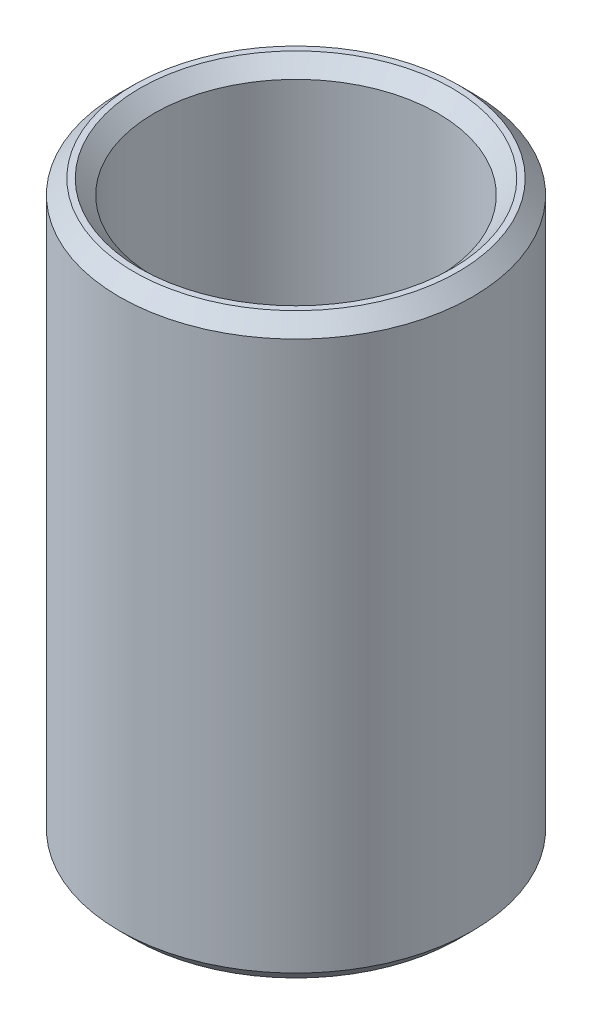
ISO-10303-21;
HEADER;
FILE_DESCRIPTION(('STEP AP214'),'2;1');
FILE_NAME('part.step','',(''),(''),'','','');
FILE_SCHEMA(('AUTOMOTIVE_DESIGN { 1 0 10303 214 1 1 1 1 }'));
ENDSEC;
DATA;
#1=APPLICATION_CONTEXT('core data for automotive mechanical design processes');
#2=APPLICATION_PROTOCOL_DEFINITION('international standard','automotive_design',2000,#1);
#3=PRODUCT_CONTEXT('',#1,'mechanical');
#4=PRODUCT('Part','Part','',(#3));
#5=PRODUCT_RELATED_PRODUCT_CATEGORY('part','',(#4));
#6=PRODUCT_DEFINITION_FORMATION('','',#4);
#7=PRODUCT_DEFINITION_CONTEXT('part definition',#1,'design');
#8=PRODUCT_DEFINITION('design','',#6,#7);
#9=PRODUCT_DEFINITION_SHAPE('','',#8);
#10=(LENGTH_UNIT() NAMED_UNIT(*) SI_UNIT(.MILLI.,.METRE.));
#11=(NAMED_UNIT(*) PLANE_ANGLE_UNIT() SI_UNIT($,.RADIAN.));
#12=(NAMED_UNIT(*) SI_UNIT($,.STERADIAN.) SOLID_ANGLE_UNIT());
#13=UNCERTAINTY_MEASURE_WITH_UNIT(LENGTH_MEASURE(1.E-05),#10,'distance_accuracy_value','');
#14=(GEOMETRIC_REPRESENTATION_CONTEXT(3) GLOBAL_UNCERTAINTY_ASSIGNED_CONTEXT((#13)) GLOBAL_UNIT_ASSIGNED_CONTEXT((#10,
#11,#12)) REPRESENTATION_CONTEXT('',''));
#15=CARTESIAN_POINT('',(0.,0.,0.));
#16=DIRECTION('',(0.,0.,1.));
#17=DIRECTION('',(1.,0.,0.));
#18=AXIS2_PLACEMENT_3D('',#15,#16,#17);
#19=CARTESIAN_POINT('',(0.,147.334308334279,0.));
#20=DIRECTION('',(0.,-1.,0.));
#21=DIRECTION('',(0.,0.,-1.));
#22=AXIS2_PLACEMENT_3D('',#19,#20,#21);
#23=CYLINDRICAL_SURFACE('',#22,45.);
#24=CARTESIAN_POINT('',(0.,3.68020604457242,0.));
#25=DIRECTION('',(0.,1.,0.));
#26=DIRECTION('',(0.,0.,1.));
#27=AXIS2_PLACEMENT_3D('',#24,#25,#26);
#28=CIRCLE('',#27,45.);
#29=CARTESIAN_POINT('',(0.,3.68020604457242,-45.));
#30=VERTEX_POINT('',#29);
#31=EDGE_CURVE('E10',#30,#30,#28,.T.);
#32=CARTESIAN_POINT('',(0.,143.654102289707,0.));
#33=DIRECTION('',(0.,1.,0.));
#34=DIRECTION('',(0.,0.,1.));
#35=AXIS2_PLACEMENT_3D('',#32,#33,#34);
#36=CIRCLE('',#35,45.);
#37=CARTESIAN_POINT('',(0.,143.654102289707,-45.));
#38=VERTEX_POINT('',#37);
#39=EDGE_CURVE('E50',#38,#38,#36,.F.);
#40=CARTESIAN_POINT('',(0.,3.68020604457242,-45.));
#41=CARTESIAN_POINT('',(0.,5.13826746379257,-45.));
#42=CARTESIAN_POINT('',(0.,6.59632888301272,-45.));
#43=CARTESIAN_POINT('',(0.,9.51245172145301,-45.));
#44=CARTESIAN_POINT('',(0.,10.9705131406732,-45.));
#45=CARTESIAN_POINT('',(0.,13.8866359791134,-45.));
#46=CARTESIAN_POINT('',(0.,15.3446973983336,-45.));
#47=CARTESIAN_POINT('',(0.,18.2608202367739,-45.));
#48=CARTESIAN_POINT('',(0.,19.718881655994,-45.));
#49=CARTESIAN_POINT('',(0.,22.6350044944343,-45.));
#50=CARTESIAN_POINT('',(0.,24.0930659136545,-45.));
#51=CARTESIAN_POINT('',(0.,27.0091887520948,-45.));
#52=CARTESIAN_POINT('',(0.,28.4672501713149,-45.));
#53=CARTESIAN_POINT('',(0.,31.3833730097552,-45.));
#54=CARTESIAN_POINT('',(0.,32.8414344289754,-45.));
#55=CARTESIAN_POINT('',(0.,35.7575572674157,-45.));
#56=CARTESIAN_POINT('',(0.,37.2156186866358,-45.));
#57=CARTESIAN_POINT('',(0.,40.1317415250761,-45.));
#58=CARTESIAN_POINT('',(0.,41.5898029442962,-45.));
#59=CARTESIAN_POINT('',(0.,44.5059257827365,-45.));
#60=CARTESIAN_POINT('',(0.,45.9639872019567,-45.));
#61=CARTESIAN_POINT('',(0.,48.880110040397,-45.));
#62=CARTESIAN_POINT('',(0.,50.3381714596171,-45.));
#63=CARTESIAN_POINT('',(0.,53.2542942980574,-45.));
#64=CARTESIAN_POINT('',(0.,54.7123557172776,-45.));
#65=CARTESIAN_POINT('',(0.,57.6284785557179,-45.));
#66=CARTESIAN_POINT('',(0.,59.086539974938,-45.));
#67=CARTESIAN_POINT('',(0.,62.0026628133783,-45.));
#68=CARTESIAN_POINT('',(0.,63.4607242325985,-45.));
#69=CARTESIAN_POINT('',(0.,66.3768470710388,-45.));
#70=CARTESIAN_POINT('',(0.,67.8349084902589,-45.));
#71=CARTESIAN_POINT('',(0.,70.7510313286992,-45.));
#72=CARTESIAN_POINT('',(0.,72.2090927479193,-45.));
#73=CARTESIAN_POINT('',(0.,75.1252155863596,-45.));
#74=CARTESIAN_POINT('',(0.,76.5832770055798,-45.));
#75=CARTESIAN_POINT('',(0.,79.4993998440201,-45.));
#76=CARTESIAN_POINT('',(0.,80.9574612632402,-45.));
#77=CARTESIAN_POINT('',(0.,83.8735841016805,-45.));
#78=CARTESIAN_POINT('',(0.,85.3316455209007,-45.));
#79=CARTESIAN_POINT('',(0.,88.247768359341,-45.));
#80=CARTESIAN_POINT('',(0.,89.7058297785611,-45.));
#81=CARTESIAN_POINT('',(0.,92.6219526170014,-45.));
#82=CARTESIAN_POINT('',(0.,94.0800140362215,-45.));
#83=CARTESIAN_POINT('',(0.,96.9961368746618,-45.));
#84=CARTESIAN_POINT('',(0.,98.454198293882,-45.));
#85=CARTESIAN_POINT('',(0.,101.370321132322,-45.));
#86=CARTESIAN_POINT('',(0.,102.828382551542,-45.));
#87=CARTESIAN_POINT('',(0.,105.744505389983,-45.));
#88=CARTESIAN_POINT('',(0.,107.202566809203,-45.));
#89=CARTESIAN_POINT('',(0.,110.118689647643,-45.));
#90=CARTESIAN_POINT('',(0.,111.576751066863,-45.));
#91=CARTESIAN_POINT('',(0.,114.492873905304,-45.));
#92=CARTESIAN_POINT('',(0.,115.950935324524,-45.));
#93=CARTESIAN_POINT('',(0.,118.867058162964,-45.));
#94=CARTESIAN_POINT('',(0.,120.325119582184,-45.));
#95=CARTESIAN_POINT('',(0.,123.241242420624,-45.));
#96=CARTESIAN_POINT('',(0.,124.699303839845,-45.));
#97=CARTESIAN_POINT('',(0.,127.615426678285,-45.));
#98=CARTESIAN_POINT('',(0.,129.073488097505,-45.));
#99=CARTESIAN_POINT('',(0.,131.989610935945,-45.));
#100=CARTESIAN_POINT('',(0.,133.447672355166,-45.));
#101=CARTESIAN_POINT('',(0.,136.363795193606,-45.));
#102=CARTESIAN_POINT('',(0.,137.821856612826,-45.));
#103=CARTESIAN_POINT('',(0.,140.737979451266,-45.));
#104=CARTESIAN_POINT('',(0.,142.196040870486,-45.));
#105=CARTESIAN_POINT('',(0.,143.654102289707,-45.));
#106=B_SPLINE_CURVE_WITH_KNOTS('',3,(#40,#41,#42,#43,#44,#45,#46,#47,#48,#49,#50,#51,#52,#53,
#54,#55,#56,#57,#58,#59,#60,#61,#62,#63,#64,#65,#66,#67,#68,#69,#70,#71,#72,#73,#74,#75,#76,#77,
#78,#79,#80,#81,#82,#83,#84,#85,#86,#87,#88,#89,#90,#91,#92,#93,#94,#95,#96,#97,#98,#99,#100,
#101,#102,#103,#104,#105),.UNSPECIFIED.,.F.,.F.,(4,2,2,2,2,2,2,2,2,2,2,2,2,2,2,2,2,2,2,2,2,2,2,
2,2,2,2,2,2,2,2,2,4),(0.,4.37418425766045,8.74836851532088,13.1225527729813,17.4967370306418,
21.8709212883022,26.2451055459627,30.6192898036231,34.9934740612835,39.367658318944,
43.7418425766044,48.1160268342649,52.4902110919253,56.8643953495857,61.2385796072462,
65.6127638649066,69.9869481225671,74.3611323802275,78.7353166378879,83.1095008955484,
87.4836851532088,91.8578694108693,96.2320536685297,100.60623792619,104.980422183851,
109.354606441511,113.728790699171,118.102974956832,122.477159214492,126.851343472153,
131.225527729813,135.599711987474,139.973896245134),.UNSPECIFIED.);
#107=EDGE_CURVE('BSEAM39',#30,#38,#106,.T.);
#108=ORIENTED_EDGE('',*,*,#31,.T.);
#109=ORIENTED_EDGE('',*,*,#39,.T.);
#110=ORIENTED_EDGE('',*,*,#107,.T.);
#111=ORIENTED_EDGE('',*,*,#107,.F.);
#112=EDGE_LOOP('',(#108,#110,#109,#111));
#113=FACE_BOUND('',#112,.T.);
#114=ADVANCED_FACE('F39',(#113),#23,.T.);
#115=CARTESIAN_POINT('',(0.,147.334308334279,0.));
#116=DIRECTION('',(0.,1.,0.));
#117=DIRECTION('',(0.,0.,1.));
#118=AXIS2_PLACEMENT_3D('',#115,#116,#117);
#119=PLANE('',#118);
#120=CARTESIAN_POINT('',(0.,147.334308334279,0.));
#121=DIRECTION('',(0.,1.,0.));
#122=DIRECTION('',(0.,0.,1.));
#123=AXIS2_PLACEMENT_3D('',#120,#121,#122);
#124=CIRCLE('',#123,39.7986737036994);
#125=CARTESIAN_POINT('',(0.,147.334308334279,39.7986737036994));
#126=VERTEX_POINT('',#125);
#127=EDGE_CURVE('E58',#126,#126,#124,.F.);
#128=ORIENTED_EDGE('',*,*,#127,.T.);
#129=EDGE_LOOP('',(#128));
#130=FACE_BOUND('',#129,.T.);
#131=CARTESIAN_POINT('',(0.,147.334308334279,0.));
#132=DIRECTION('',(0.,1.,0.));
#133=DIRECTION('',(0.,0.,1.));
#134=AXIS2_PLACEMENT_3D('',#131,#132,#133);
#135=CIRCLE('',#134,41.3197939554276);
#136=CARTESIAN_POINT('',(0.,147.334308334279,-41.3197939554276));
#137=VERTEX_POINT('',#136);
#138=EDGE_CURVE('E61',#137,#137,#135,.T.);
#139=ORIENTED_EDGE('',*,*,#138,.T.);
#140=EDGE_LOOP('',(#139));
#141=FACE_BOUND('',#140,.T.);
#142=ADVANCED_FACE('F88',(#130,#141),#119,.T.);
#143=CARTESIAN_POINT('',(0.,0.,0.));
#144=DIRECTION('',(0.,1.,0.));
#145=DIRECTION('',(0.,0.,1.));
#146=AXIS2_PLACEMENT_3D('',#143,#144,#145);
#147=PLANE('',#146);
#148=CARTESIAN_POINT('',(0.,0.,0.));
#149=DIRECTION('',(0.,1.,0.));
#150=DIRECTION('',(0.,0.,1.));
#151=AXIS2_PLACEMENT_3D('',#148,#149,#150);
#152=CIRCLE('',#151,39.7986737036993);
#153=CARTESIAN_POINT('',(0.,0.,-39.7986737036993));
#154=VERTEX_POINT('',#153);
#155=EDGE_CURVE('E51',#154,#154,#152,.T.);
#156=ORIENTED_EDGE('',*,*,#155,.T.);
#157=EDGE_LOOP('',(#156));
#158=FACE_BOUND('',#157,.T.);
#159=CARTESIAN_POINT('',(0.,0.,0.));
#160=DIRECTION('',(0.,1.,0.));
#161=DIRECTION('',(0.,0.,1.));
#162=AXIS2_PLACEMENT_3D('',#159,#160,#161);
#163=CIRCLE('',#162,41.3197939554276);
#164=CARTESIAN_POINT('',(0.,0.,41.3197939554276));
#165=VERTEX_POINT('',#164);
#166=EDGE_CURVE('E54',#165,#165,#163,.F.);
#167=ORIENTED_EDGE('',*,*,#166,.T.);
#168=EDGE_LOOP('',(#167));
#169=FACE_BOUND('',#168,.T.);
#170=ADVANCED_FACE('F83',(#158,#169),#147,.F.);
#171=CARTESIAN_POINT('',(0.,147.334308334279,0.));
#172=DIRECTION('',(0.,-1.,0.));
#173=DIRECTION('',(0.,0.,-1.));
#174=AXIS2_PLACEMENT_3D('',#171,#172,#173);
#175=CYLINDRICAL_SURFACE('',#174,36.1184676591269);
#176=CARTESIAN_POINT('',(0.,143.654102289706,0.));
#177=DIRECTION('',(0.,1.,0.));
#178=DIRECTION('',(0.,0.,1.));
#179=AXIS2_PLACEMENT_3D('',#176,#177,#178);
#180=CIRCLE('',#179,36.1184676591269);
#181=CARTESIAN_POINT('',(0.,143.654102289706,36.1184676591269));
#182=VERTEX_POINT('',#181);
#183=EDGE_CURVE('E67',#182,#182,#180,.T.);
#184=ORIENTED_EDGE('',*,*,#183,.T.);
#185=EDGE_LOOP('',(#184));
#186=FACE_BOUND('',#185,.T.);
#187=CARTESIAN_POINT('',(0.,3.68020604457248,0.));
#188=DIRECTION('',(0.,1.,0.));
#189=DIRECTION('',(0.,0.,1.));
#190=AXIS2_PLACEMENT_3D('',#187,#188,#189);
#191=CIRCLE('',#190,36.1184676591269);
#192=CARTESIAN_POINT('',(0.,3.68020604457248,-36.1184676591269));
#193=VERTEX_POINT('',#192);
#194=EDGE_CURVE('E69',#193,#193,#191,.F.);
#195=ORIENTED_EDGE('',*,*,#194,.T.);
#196=EDGE_LOOP('',(#195));
#197=FACE_BOUND('',#196,.T.);
#198=ADVANCED_FACE('F71',(#186,#197),#175,.F.);
#199=CARTESIAN_POINT('',(0.,143.654102289706,0.));
#200=DIRECTION('',(0.,1.,0.));
#201=DIRECTION('',(0.,0.,1.));
#202=AXIS2_PLACEMENT_3D('',#199,#200,#201);
#203=CONICAL_SURFACE('',#202,36.1184676591269,0.78539816339745);
#204=ORIENTED_EDGE('',*,*,#127,.F.);
#205=EDGE_LOOP('',(#204));
#206=FACE_BOUND('',#205,.T.);
#207=ORIENTED_EDGE('',*,*,#183,.F.);
#208=EDGE_LOOP('',(#207));
#209=FACE_BOUND('',#208,.T.);
#210=ADVANCED_FACE('F77',(#206,#209),#203,.F.);
#211=CARTESIAN_POINT('',(0.,0.,0.));
#212=DIRECTION('',(0.,-1.,0.));
#213=DIRECTION('',(0.,0.,-1.));
#214=AXIS2_PLACEMENT_3D('',#211,#212,#213);
#215=CONICAL_SURFACE('',#214,39.7986737036993,0.785398163397445);
#216=CARTESIAN_POINT('',(0.,3.68020604457248,-36.1184676591269));
#217=CARTESIAN_POINT('',(0.,3.64187056494151,-36.1568031387579));
#218=CARTESIAN_POINT('',(0.,3.60353508531055,-36.1951386183888));
#219=CARTESIAN_POINT('',(0.,3.52686412604862,-36.2718095776507));
#220=CARTESIAN_POINT('',(0.,3.48852864641766,-36.3101450572817));
#221=CARTESIAN_POINT('',(0.,3.41185768715573,-36.3868160165436));
#222=CARTESIAN_POINT('',(0.,3.37352220752477,-36.4251514961746));
#223=CARTESIAN_POINT('',(0.,3.29685124826284,-36.5018224554365));
#224=CARTESIAN_POINT('',(0.,3.25851576863188,-36.5401579350675));
#225=CARTESIAN_POINT('',(0.,3.18184480936995,-36.6168288943294));
#226=CARTESIAN_POINT('',(0.,3.14350932973899,-36.6551643739604));
#227=CARTESIAN_POINT('',(0.,3.06683837047706,-36.7318353332223));
#228=CARTESIAN_POINT('',(0.,3.0285028908461,-36.7701708128533));
#229=CARTESIAN_POINT('',(0.,2.95183193158417,-36.8468417721152));
#230=CARTESIAN_POINT('',(0.,2.91349645195321,-36.8851772517462));
#231=CARTESIAN_POINT('',(0.,2.83682549269128,-36.9618482110081));
#232=CARTESIAN_POINT('',(0.,2.79849001306032,-37.000183690639));
#233=CARTESIAN_POINT('',(0.,2.72181905379839,-37.076854649901));
#234=CARTESIAN_POINT('',(0.,2.68348357416743,-37.1151901295319));
#235=CARTESIAN_POINT('',(0.,2.6068126149055,-37.1918610887939));
#236=CARTESIAN_POINT('',(0.,2.56847713527454,-37.2301965684248));
#237=CARTESIAN_POINT('',(0.,2.49180617601261,-37.3068675276867));
#238=CARTESIAN_POINT('',(0.,2.45347069638165,-37.3452030073177));
#239=CARTESIAN_POINT('',(0.,2.37679973711972,-37.4218739665796));
#240=CARTESIAN_POINT('',(0.,2.33846425748876,-37.4602094462106));
#241=CARTESIAN_POINT('',(0.,2.26179329822683,-37.5368804054725));
#242=CARTESIAN_POINT('',(0.,2.22345781859587,-37.5752158851035));
#243=CARTESIAN_POINT('',(0.,2.14678685933394,-37.6518868443654));
#244=CARTESIAN_POINT('',(0.,2.10845137970298,-37.6902223239964));
#245=CARTESIAN_POINT('',(0.,2.03178042044105,-37.7668932832583));
#246=CARTESIAN_POINT('',(0.,1.99344494081009,-37.8052287628893));
#247=CARTESIAN_POINT('',(0.,1.91677398154816,-37.8818997221512));
#248=CARTESIAN_POINT('',(0.,1.8784385019172,-37.9202352017822));
#249=CARTESIAN_POINT('',(0.,1.80176754265527,-37.9969061610441));
#250=CARTESIAN_POINT('',(0.,1.76343206302431,-38.035241640675));
#251=CARTESIAN_POINT('',(0.,1.68676110376238,-38.111912599937));
#252=CARTESIAN_POINT('',(0.,1.64842562413142,-38.1502480795679));
#253=CARTESIAN_POINT('',(0.,1.57175466486949,-38.2269190388299));
#254=CARTESIAN_POINT('',(0.,1.53341918523853,-38.2652545184608));
#255=CARTESIAN_POINT('',(0.,1.4567482259766,-38.3419254777227));
#256=CARTESIAN_POINT('',(0.,1.41841274634564,-38.3802609573537));
#257=CARTESIAN_POINT('',(0.,1.34174178708371,-38.4569319166156));
#258=CARTESIAN_POINT('',(0.,1.30340630745275,-38.4952673962466));
#259=CARTESIAN_POINT('',(0.,1.22673534819083,-38.5719383555085));
#260=CARTESIAN_POINT('',(0.,1.18839986855986,-38.6102738351395));
#261=CARTESIAN_POINT('',(0.,1.11172890929793,-38.6869447944014));
#262=CARTESIAN_POINT('',(0.,1.07339342966697,-38.7252802740324));
#263=CARTESIAN_POINT('',(0.,0.996722470405045,-38.8019512332943));
#264=CARTESIAN_POINT('',(0.,0.958386990774082,-38.8402867129253));
#265=CARTESIAN_POINT('',(0.,0.881716031512156,-38.9169576721872));
#266=CARTESIAN_POINT('',(0.,0.843380551881192,-38.9552931518182));
#267=CARTESIAN_POINT('',(0.,0.766709592619266,-39.0319641110801));
#268=CARTESIAN_POINT('',(0.,0.728374112988303,-39.070299590711));
#269=CARTESIAN_POINT('',(0.,0.651703153726376,-39.146970549973));
#270=CARTESIAN_POINT('',(0.,0.613367674095412,-39.1853060296039));
#271=CARTESIAN_POINT('',(0.,0.536696714833486,-39.2619769888659));
#272=CARTESIAN_POINT('',(0.,0.498361235202523,-39.3003124684968));
#273=CARTESIAN_POINT('',(0.,0.421690275940597,-39.3769834277588));
#274=CARTESIAN_POINT('',(0.,0.383354796309633,-39.4153189073897));
#275=CARTESIAN_POINT('',(0.,0.306683837047706,-39.4919898666516));
#276=CARTESIAN_POINT('',(0.,0.268348357416743,-39.5303253462826));
#277=CARTESIAN_POINT('',(0.,0.191677398154816,-39.6069963055445));
#278=CARTESIAN_POINT('',(0.,0.153341918523853,-39.6453317851755));
#279=CARTESIAN_POINT('',(0.,0.0766709592619265,-39.7220027444374));
#280=CARTESIAN_POINT('',(0.,0.0383354796309632,-39.7603382240684));
#281=CARTESIAN_POINT('',(0.,0.,-39.7986737036993));
#282=B_SPLINE_CURVE_WITH_KNOTS('',3,(#216,#217,#218,#219,#220,#221,#222,#223,#224,#225,#226,
#227,#228,#229,#230,#231,#232,#233,#234,#235,#236,#237,#238,#239,#240,#241,#242,#243,#244,#245,
#246,#247,#248,#249,#250,#251,#252,#253,#254,#255,#256,#257,#258,#259,#260,#261,#262,#263,#264,
#265,#266,#267,#268,#269,#270,#271,#272,#273,#274,#275,#276,#277,#278,#279,#280,#281),
.UNSPECIFIED.,.F.,.F.,(4,2,2,2,2,2,2,2,2,2,2,2,2,2,2,2,2,2,2,2,2,2,2,2,2,2,2,2,2,2,2,2,4),(0.,
0.162643665642556,0.325287331285112,0.487930996927669,0.650574662570225,0.813218328212786,
0.975861993855342,1.1385056594979,1.30114932514045,1.46379299078301,1.62643665642557,
1.78908032206812,1.95172398771068,2.11436765335324,2.2770113189958,2.43965498463835,
2.60229865028091,2.76494231592347,2.92758598156602,3.09022964720858,3.25287331285113,
3.4155169784937,3.57816064413625,3.74080430977881,3.90344797542137,4.06609164106392,
4.22873530670648,4.39137897234903,4.5540226379916,4.71666630363415,4.87930996927671,
5.04195363491926,5.20459730056182),.UNSPECIFIED.);
#283=EDGE_CURVE('BSEAM73',#193,#154,#282,.T.);
#284=ORIENTED_EDGE('',*,*,#194,.F.);
#285=ORIENTED_EDGE('',*,*,#155,.F.);
#286=ORIENTED_EDGE('',*,*,#283,.T.);
#287=ORIENTED_EDGE('',*,*,#283,.F.);
#288=EDGE_LOOP('',(#284,#286,#285,#287));
#289=FACE_BOUND('',#288,.T.);
#290=ADVANCED_FACE('F73',(#289),#215,.F.);
#291=CARTESIAN_POINT('',(0.,3.68020604457242,0.));
#292=DIRECTION('',(0.,1.,0.));
#293=DIRECTION('',(0.,0.,1.));
#294=AXIS2_PLACEMENT_3D('',#291,#292,#293);
#295=CONICAL_SURFACE('',#294,45.,0.785398163397452);
#296=ORIENTED_EDGE('',*,*,#166,.F.);
#297=EDGE_LOOP('',(#296));
#298=FACE_BOUND('',#297,.T.);
#299=ORIENTED_EDGE('',*,*,#31,.F.);
#300=EDGE_LOOP('',(#299));
#301=FACE_BOUND('',#300,.T.);
#302=ADVANCED_FACE('F76',(#298,#301),#295,.T.);
#303=CARTESIAN_POINT('',(0.,147.334308334279,0.));
#304=DIRECTION('',(0.,-1.,0.));
#305=DIRECTION('',(0.,0.,-1.));
#306=AXIS2_PLACEMENT_3D('',#303,#304,#305);
#307=CONICAL_SURFACE('',#306,41.3197939554276,0.785398163397443);
#308=CARTESIAN_POINT('',(0.,143.654102289707,-45.));
#309=CARTESIAN_POINT('',(0.,143.692437769337,-44.9616645203691));
#310=CARTESIAN_POINT('',(0.,143.730773248968,-44.9233290407381));
#311=CARTESIAN_POINT('',(0.,143.80744420823,-44.8466580814762));
#312=CARTESIAN_POINT('',(0.,143.845779687861,-44.8083226018452));
#313=CARTESIAN_POINT('',(0.,143.922450647123,-44.7316516425833));
#314=CARTESIAN_POINT('',(0.,143.960786126754,-44.6933161629523));
#315=CARTESIAN_POINT('',(0.,144.037457086016,-44.6166452036904));
#316=CARTESIAN_POINT('',(0.,144.075792565647,-44.5783097240594));
#317=CARTESIAN_POINT('',(0.,144.152463524909,-44.5016387647975));
#318=CARTESIAN_POINT('',(0.,144.19079900454,-44.4633032851665));
#319=CARTESIAN_POINT('',(0.,144.267469963802,-44.3866323259046));
#320=CARTESIAN_POINT('',(0.,144.305805443433,-44.3482968462736));
#321=CARTESIAN_POINT('',(0.,144.382476402695,-44.2716258870117));
#322=CARTESIAN_POINT('',(0.,144.420811882326,-44.2332904073808));
#323=CARTESIAN_POINT('',(0.,144.497482841588,-44.1566194481188));
#324=CARTESIAN_POINT('',(0.,144.535818321219,-44.1182839684879));
#325=CARTESIAN_POINT('',(0.,144.612489280481,-44.041613009226));
#326=CARTESIAN_POINT('',(0.,144.650824760112,-44.003277529595));
#327=CARTESIAN_POINT('',(0.,144.727495719374,-43.9266065703331));
#328=CARTESIAN_POINT('',(0.,144.765831199004,-43.8882710907021));
#329=CARTESIAN_POINT('',(0.,144.842502158266,-43.8116001314402));
#330=CARTESIAN_POINT('',(0.,144.880837637897,-43.7732646518092));
#331=CARTESIAN_POINT('',(0.,144.957508597159,-43.6965936925473));
#332=CARTESIAN_POINT('',(0.,144.99584407679,-43.6582582129163));
#333=CARTESIAN_POINT('',(0.,145.072515036052,-43.5815872536544));
#334=CARTESIAN_POINT('',(0.,145.110850515683,-43.5432517740234));
#335=CARTESIAN_POINT('',(0.,145.187521474945,-43.4665808147615));
#336=CARTESIAN_POINT('',(0.,145.225856954576,-43.4282453351305));
#337=CARTESIAN_POINT('',(0.,145.302527913838,-43.3515743758686));
#338=CARTESIAN_POINT('',(0.,145.340863393469,-43.3132388962377));
#339=CARTESIAN_POINT('',(0.,145.417534352731,-43.2365679369757));
#340=CARTESIAN_POINT('',(0.,145.455869832362,-43.1982324573448));
#341=CARTESIAN_POINT('',(0.,145.532540791624,-43.1215614980828));
#342=CARTESIAN_POINT('',(0.,145.570876271255,-43.0832260184519));
#343=CARTESIAN_POINT('',(0.,145.647547230517,-43.00655505919));
#344=CARTESIAN_POINT('',(0.,145.685882710148,-42.968219579559));
#345=CARTESIAN_POINT('',(0.,145.76255366941,-42.8915486202971));
#346=CARTESIAN_POINT('',(0.,145.80088914904,-42.8532131406661));
#347=CARTESIAN_POINT('',(0.,145.877560108302,-42.7765421814042));
#348=CARTESIAN_POINT('',(0.,145.915895587933,-42.7382067017732));
#349=CARTESIAN_POINT('',(0.,145.992566547195,-42.6615357425113));
#350=CARTESIAN_POINT('',(0.,146.030902026826,-42.6232002628803));
#351=CARTESIAN_POINT('',(0.,146.107572986088,-42.5465293036184));
#352=CARTESIAN_POINT('',(0.,146.145908465719,-42.5081938239874));
#353=CARTESIAN_POINT('',(0.,146.222579424981,-42.4315228647255));
#354=CARTESIAN_POINT('',(0.,146.260914904612,-42.3931873850945));
#355=CARTESIAN_POINT('',(0.,146.337585863874,-42.3165164258326));
#356=CARTESIAN_POINT('',(0.,146.375921343505,-42.2781809462017));
#357=CARTESIAN_POINT('',(0.,146.452592302767,-42.2015099869397));
#358=CARTESIAN_POINT('',(0.,146.490927782398,-42.1631745073088));
#359=CARTESIAN_POINT('',(0.,146.56759874166,-42.0865035480468));
#360=CARTESIAN_POINT('',(0.,146.605934221291,-42.0481680684159));
#361=CARTESIAN_POINT('',(0.,146.682605180553,-41.971497109154));
#362=CARTESIAN_POINT('',(0.,146.720940660184,-41.933161629523));
#363=CARTESIAN_POINT('',(0.,146.797611619446,-41.8564906702611));
#364=CARTESIAN_POINT('',(0.,146.835947099076,-41.8181551906301));
#365=CARTESIAN_POINT('',(0.,146.912618058338,-41.7414842313682));
#366=CARTESIAN_POINT('',(0.,146.950953537969,-41.7031487517372));
#367=CARTESIAN_POINT('',(0.,147.027624497231,-41.6264777924753));
#368=CARTESIAN_POINT('',(0.,147.065959976862,-41.5881423128443));
#369=CARTESIAN_POINT('',(0.,147.142630936124,-41.5114713535824));
#370=CARTESIAN_POINT('',(0.,147.180966415755,-41.4731358739514));
#371=CARTESIAN_POINT('',(0.,147.257637375017,-41.3964649146895));
#372=CARTESIAN_POINT('',(0.,147.295972854648,-41.3581294350585));
#373=CARTESIAN_POINT('',(0.,147.334308334279,-41.3197939554276));
#374=B_SPLINE_CURVE_WITH_KNOTS('',3,(#308,#309,#310,#311,#312,#313,#314,#315,#316,#317,#318,
#319,#320,#321,#322,#323,#324,#325,#326,#327,#328,#329,#330,#331,#332,#333,#334,#335,#336,#337,
#338,#339,#340,#341,#342,#343,#344,#345,#346,#347,#348,#349,#350,#351,#352,#353,#354,#355,#356,
#357,#358,#359,#360,#361,#362,#363,#364,#365,#366,#367,#368,#369,#370,#371,#372,#373),
.UNSPECIFIED.,.F.,.F.,(4,2,2,2,2,2,2,2,2,2,2,2,2,2,2,2,2,2,2,2,2,2,2,2,2,2,2,2,2,2,2,2,4),(0.,
0.16264366564256,0.32528733128512,0.48793099692768,0.65057466257024,0.8132183282128,
0.97586199385534,1.1385056594979,1.30114932514046,1.46379299078302,1.62643665642558,
1.78908032206812,1.95172398771068,2.11436765335324,2.2770113189958,2.43965498463836,
2.6022986502809,2.76494231592346,2.92758598156602,3.09022964720858,3.25287331285114,
3.4155169784937,3.57816064413624,3.7408043097788,3.90344797542136,4.06609164106393,
4.22873530670649,4.39137897234903,4.55402263799159,4.71666630363415,4.87930996927671,
5.04195363491927,5.20459730056183),.UNSPECIFIED.);
#375=EDGE_CURVE('BSEAM45',#38,#137,#374,.T.);
#376=ORIENTED_EDGE('',*,*,#39,.F.);
#377=ORIENTED_EDGE('',*,*,#138,.F.);
#378=ORIENTED_EDGE('',*,*,#375,.T.);
#379=ORIENTED_EDGE('',*,*,#375,.F.);
#380=EDGE_LOOP('',(#376,#378,#377,#379));
#381=FACE_BOUND('',#380,.T.);
#382=ADVANCED_FACE('F45',(#381),#307,.T.);
#383=CLOSED_SHELL('',(#114,#142,#170,#198,#210,#290,#302,#382));
#384=MANIFOLD_SOLID_BREP('B2',#383);
#385=ADVANCED_BREP_SHAPE_REPRESENTATION('',(#18,#384),#14);
#386=SHAPE_DEFINITION_REPRESENTATION(#9,#385);
ENDSEC;
END-ISO-10303-21;
